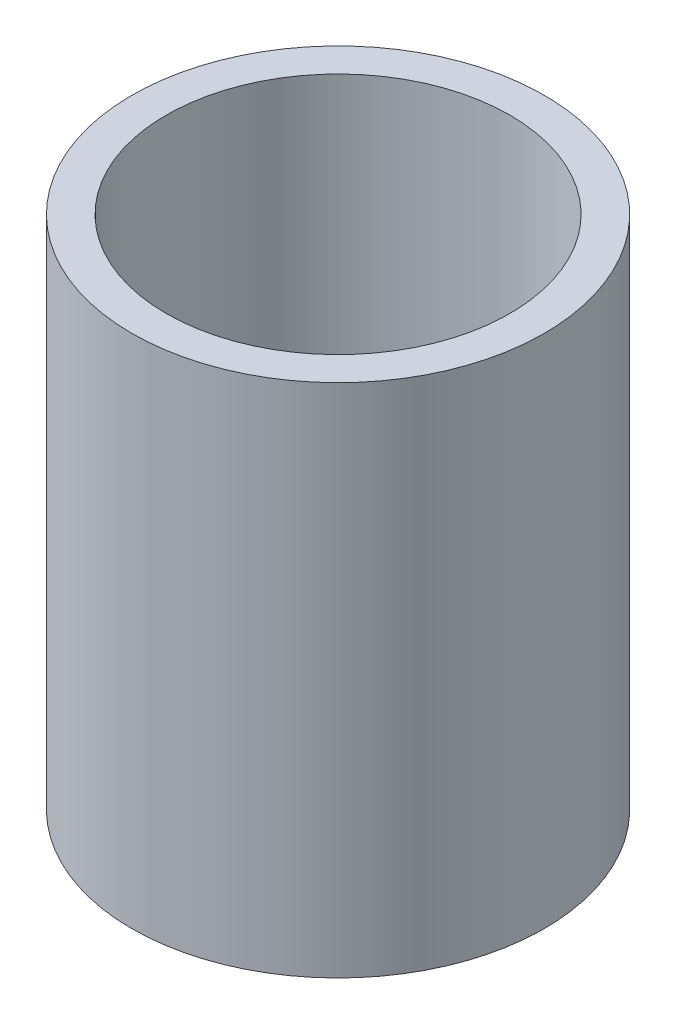
ISO-10303-21;
HEADER;
FILE_DESCRIPTION(('STEP AP214'),'2;1');
FILE_NAME('part.step','',(''),(''),'','','');
FILE_SCHEMA(('AUTOMOTIVE_DESIGN { 1 0 10303 214 1 1 1 1 }'));
ENDSEC;
DATA;
#1=APPLICATION_CONTEXT('core data for automotive mechanical design processes');
#2=APPLICATION_PROTOCOL_DEFINITION('international standard','automotive_design',2000,#1);
#3=PRODUCT_CONTEXT('',#1,'mechanical');
#4=PRODUCT('Part','Part','',(#3));
#5=PRODUCT_RELATED_PRODUCT_CATEGORY('part','',(#4));
#6=PRODUCT_DEFINITION_FORMATION('','',#4);
#7=PRODUCT_DEFINITION_CONTEXT('part definition',#1,'design');
#8=PRODUCT_DEFINITION('design','',#6,#7);
#9=PRODUCT_DEFINITION_SHAPE('','',#8);
#10=(LENGTH_UNIT() NAMED_UNIT(*) SI_UNIT(.MILLI.,.METRE.));
#11=(NAMED_UNIT(*) PLANE_ANGLE_UNIT() SI_UNIT($,.RADIAN.));
#12=(NAMED_UNIT(*) SI_UNIT($,.STERADIAN.) SOLID_ANGLE_UNIT());
#13=UNCERTAINTY_MEASURE_WITH_UNIT(LENGTH_MEASURE(1.E-05),#10,'distance_accuracy_value','');
#14=(GEOMETRIC_REPRESENTATION_CONTEXT(3) GLOBAL_UNCERTAINTY_ASSIGNED_CONTEXT((#13)) GLOBAL_UNIT_ASSIGNED_CONTEXT((#10,
#11,#12)) REPRESENTATION_CONTEXT('',''));
#15=CARTESIAN_POINT('',(0.,0.,0.));
#16=DIRECTION('',(0.,0.,1.));
#17=DIRECTION('',(1.,0.,0.));
#18=AXIS2_PLACEMENT_3D('',#15,#16,#17);
#19=CARTESIAN_POINT('',(0.,150.,0.));
#20=DIRECTION('',(0.,1.,0.));
#21=DIRECTION('',(0.,0.,1.));
#22=AXIS2_PLACEMENT_3D('',#19,#20,#21);
#23=PLANE('',#22);
#24=CARTESIAN_POINT('',(0.,150.,0.));
#25=DIRECTION('',(0.,1.,0.));
#26=DIRECTION('',(0.,0.,1.));
#27=AXIS2_PLACEMENT_3D('',#24,#25,#26);
#28=CIRCLE('',#27,60.);
#29=CARTESIAN_POINT('',(0.,150.,60.));
#30=VERTEX_POINT('',#29);
#31=EDGE_CURVE('E10',#30,#30,#28,.T.);
#32=ORIENTED_EDGE('',*,*,#31,.T.);
#33=EDGE_LOOP('',(#32));
#34=FACE_BOUND('',#33,.T.);
#35=CARTESIAN_POINT('',(0.,150.,0.));
#36=DIRECTION('',(0.,1.,0.));
#37=DIRECTION('',(0.,0.,1.));
#38=AXIS2_PLACEMENT_3D('',#35,#36,#37);
#39=CIRCLE('',#38,50.);
#40=CARTESIAN_POINT('',(0.,150.,50.));
#41=VERTEX_POINT('',#40);
#42=EDGE_CURVE('E45',#41,#41,#39,.T.);
#43=ORIENTED_EDGE('',*,*,#42,.F.);
#44=EDGE_LOOP('',(#43));
#45=FACE_BOUND('',#44,.T.);
#46=ADVANCED_FACE('F34',(#34,#45),#23,.T.);
#47=CARTESIAN_POINT('',(0.,0.,0.));
#48=DIRECTION('',(0.,1.,0.));
#49=DIRECTION('',(0.,0.,1.));
#50=AXIS2_PLACEMENT_3D('',#47,#48,#49);
#51=PLANE('',#50);
#52=CARTESIAN_POINT('',(0.,0.,0.));
#53=DIRECTION('',(0.,1.,0.));
#54=DIRECTION('',(0.,0.,1.));
#55=AXIS2_PLACEMENT_3D('',#52,#53,#54);
#56=CIRCLE('',#55,60.);
#57=CARTESIAN_POINT('',(0.,0.,60.));
#58=VERTEX_POINT('',#57);
#59=EDGE_CURVE('E38',#58,#58,#56,.T.);
#60=ORIENTED_EDGE('',*,*,#59,.F.);
#61=EDGE_LOOP('',(#60));
#62=FACE_BOUND('',#61,.T.);
#63=CARTESIAN_POINT('',(0.,0.,0.));
#64=DIRECTION('',(0.,1.,0.));
#65=DIRECTION('',(0.,0.,1.));
#66=AXIS2_PLACEMENT_3D('',#63,#64,#65);
#67=CIRCLE('',#66,50.);
#68=CARTESIAN_POINT('',(0.,0.,50.));
#69=VERTEX_POINT('',#68);
#70=EDGE_CURVE('E47',#69,#69,#67,.T.);
#71=ORIENTED_EDGE('',*,*,#70,.T.);
#72=EDGE_LOOP('',(#71));
#73=FACE_BOUND('',#72,.T.);
#74=ADVANCED_FACE('F57',(#62,#73),#51,.F.);
#75=CARTESIAN_POINT('',(0.,150.,0.));
#76=DIRECTION('',(0.,-1.,0.));
#77=DIRECTION('',(0.,0.,-1.));
#78=AXIS2_PLACEMENT_3D('',#75,#76,#77);
#79=CYLINDRICAL_SURFACE('',#78,60.);
#80=ORIENTED_EDGE('',*,*,#31,.F.);
#81=EDGE_LOOP('',(#80));
#82=FACE_BOUND('',#81,.T.);
#83=ORIENTED_EDGE('',*,*,#59,.T.);
#84=EDGE_LOOP('',(#83));
#85=FACE_BOUND('',#84,.T.);
#86=ADVANCED_FACE('F36',(#82,#85),#79,.T.);
#87=CARTESIAN_POINT('',(0.,150.,0.));
#88=DIRECTION('',(0.,-1.,0.));
#89=DIRECTION('',(0.,0.,-1.));
#90=AXIS2_PLACEMENT_3D('',#87,#88,#89);
#91=CYLINDRICAL_SURFACE('',#90,50.);
#92=ORIENTED_EDGE('',*,*,#42,.T.);
#93=EDGE_LOOP('',(#92));
#94=FACE_BOUND('',#93,.T.);
#95=ORIENTED_EDGE('',*,*,#70,.F.);
#96=EDGE_LOOP('',(#95));
#97=FACE_BOUND('',#96,.T.);
#98=ADVANCED_FACE('F53',(#94,#97),#91,.F.);
#99=CLOSED_SHELL('',(#46,#74,#86,#98));
#100=MANIFOLD_SOLID_BREP('B2',#99);
#101=ADVANCED_BREP_SHAPE_REPRESENTATION('',(#18,#100),#14);
#102=SHAPE_DEFINITION_REPRESENTATION(#9,#101);
ENDSEC;
END-ISO-10303-21;
